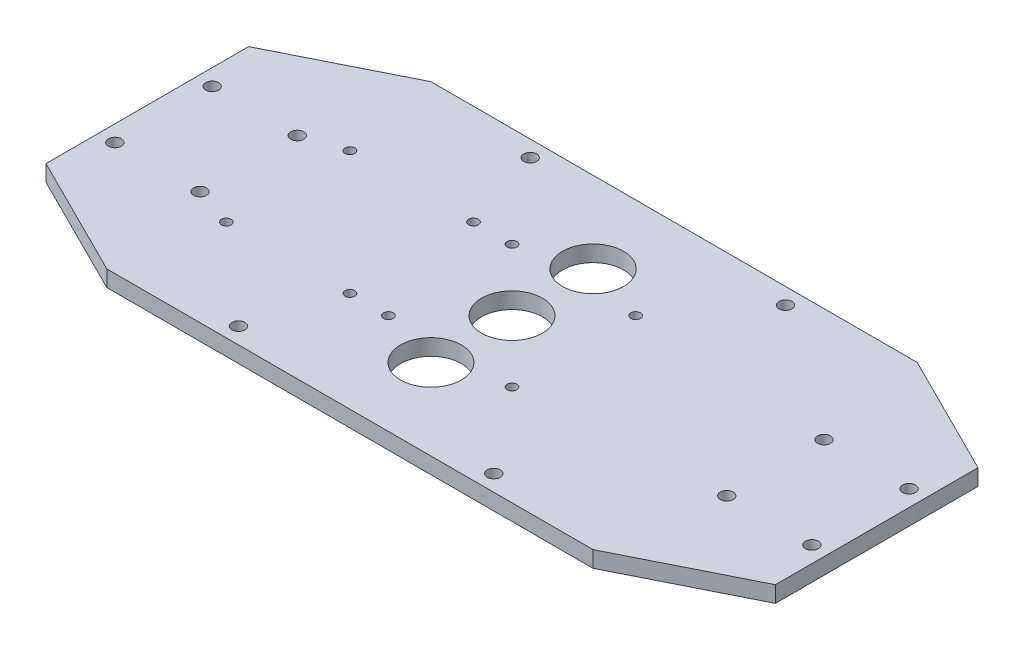
ISO-10303-21;
HEADER;
FILE_DESCRIPTION(('STEP AP214'),'2;1');
FILE_NAME('part.step','',(''),(''),'','','');
FILE_SCHEMA(('AUTOMOTIVE_DESIGN { 1 0 10303 214 1 1 1 1 }'));
ENDSEC;
DATA;
#1=APPLICATION_CONTEXT('core data for automotive mechanical design processes');
#2=APPLICATION_PROTOCOL_DEFINITION('international standard','automotive_design',2000,#1);
#3=PRODUCT_CONTEXT('',#1,'mechanical');
#4=PRODUCT('Part','Part','',(#3));
#5=PRODUCT_RELATED_PRODUCT_CATEGORY('part','',(#4));
#6=PRODUCT_DEFINITION_FORMATION('','',#4);
#7=PRODUCT_DEFINITION_CONTEXT('part definition',#1,'design');
#8=PRODUCT_DEFINITION('design','',#6,#7);
#9=PRODUCT_DEFINITION_SHAPE('','',#8);
#10=(LENGTH_UNIT() NAMED_UNIT(*) SI_UNIT(.MILLI.,.METRE.));
#11=(NAMED_UNIT(*) PLANE_ANGLE_UNIT() SI_UNIT($,.RADIAN.));
#12=(NAMED_UNIT(*) SI_UNIT($,.STERADIAN.) SOLID_ANGLE_UNIT());
#13=UNCERTAINTY_MEASURE_WITH_UNIT(LENGTH_MEASURE(1.E-05),#10,'distance_accuracy_value','');
#14=(GEOMETRIC_REPRESENTATION_CONTEXT(3) GLOBAL_UNCERTAINTY_ASSIGNED_CONTEXT((#13)) GLOBAL_UNIT_ASSIGNED_CONTEXT((#10,
#11,#12)) REPRESENTATION_CONTEXT('',''));
#15=CARTESIAN_POINT('',(0.,0.,0.));
#16=DIRECTION('',(0.,0.,1.));
#17=DIRECTION('',(1.,0.,0.));
#18=AXIS2_PLACEMENT_3D('',#15,#16,#17);
#19=CARTESIAN_POINT('',(0.,4.,0.));
#20=DIRECTION('',(0.,-1.,0.));
#21=DIRECTION('',(0.,0.,-1.));
#22=AXIS2_PLACEMENT_3D('',#19,#20,#21);
#23=PLANE('',#22);
#24=CARTESIAN_POINT('',(90.0000000000004,4.,-60.));
#25=DIRECTION('',(0.,1.,0.));
#26=DIRECTION('',(0.,0.,1.));
#27=AXIS2_PLACEMENT_3D('',#24,#25,#26);
#28=CIRCLE('',#27,7.53400516805174);
#29=CARTESIAN_POINT('',(90.0000000000004,4.,-52.4659948319483));
#30=VERTEX_POINT('',#29);
#31=EDGE_CURVE('E142',#30,#30,#28,.T.);
#32=ORIENTED_EDGE('',*,*,#31,.F.);
#33=EDGE_LOOP('',(#32));
#34=FACE_BOUND('',#33,.T.);
#35=CARTESIAN_POINT('',(90.0000000000004,4.,-40.));
#36=DIRECTION('',(0.,1.,0.));
#37=DIRECTION('',(0.,0.,1.));
#38=AXIS2_PLACEMENT_3D('',#35,#36,#37);
#39=CIRCLE('',#38,7.50000000000001);
#40=CARTESIAN_POINT('',(90.0000000000004,4.,-32.5));
#41=VERTEX_POINT('',#40);
#42=EDGE_CURVE('E625',#41,#41,#39,.T.);
#43=ORIENTED_EDGE('',*,*,#42,.F.);
#44=EDGE_LOOP('',(#43));
#45=FACE_BOUND('',#44,.T.);
#46=CARTESIAN_POINT('',(90.0000000000004,4.,-20.));
#47=DIRECTION('',(0.,1.,0.));
#48=DIRECTION('',(0.,0.,1.));
#49=AXIS2_PLACEMENT_3D('',#46,#47,#48);
#50=CIRCLE('',#49,7.50000000000001);
#51=CARTESIAN_POINT('',(90.0000000000004,4.,-12.5));
#52=VERTEX_POINT('',#51);
#53=EDGE_CURVE('E159',#52,#52,#50,.T.);
#54=ORIENTED_EDGE('',*,*,#53,.F.);
#55=EDGE_LOOP('',(#54));
#56=FACE_BOUND('',#55,.T.);
#57=CARTESIAN_POINT('',(3.99999999999812,4.,-52.0000000000011));
#58=DIRECTION('',(0.,1.,0.));
#59=DIRECTION('',(0.,0.,1.));
#60=AXIS2_PLACEMENT_3D('',#57,#58,#59);
#61=CIRCLE('',#60,1.59999999999999);
#62=CARTESIAN_POINT('',(3.99999999999812,4.,-50.4000000000011));
#63=VERTEX_POINT('',#62);
#64=EDGE_CURVE('E147',#63,#63,#61,.T.);
#65=ORIENTED_EDGE('',*,*,#64,.F.);
#66=EDGE_LOOP('',(#65));
#67=FACE_BOUND('',#66,.T.);
#68=CARTESIAN_POINT('',(24.9999999999979,4.,-28.0000000000009));
#69=DIRECTION('',(0.,1.,0.));
#70=DIRECTION('',(0.,0.,1.));
#71=AXIS2_PLACEMENT_3D('',#68,#69,#70);
#72=CIRCLE('',#71,1.59999999999999);
#73=CARTESIAN_POINT('',(24.9999999999979,4.,-26.4000000000009));
#74=VERTEX_POINT('',#73);
#75=EDGE_CURVE('E167',#74,#74,#72,.T.);
#76=ORIENTED_EDGE('',*,*,#75,.F.);
#77=EDGE_LOOP('',(#76));
#78=FACE_BOUND('',#77,.T.);
#79=CARTESIAN_POINT('',(24.9999999999981,4.,-52.0000000000009));
#80=DIRECTION('',(0.,1.,0.));
#81=DIRECTION('',(0.,0.,1.));
#82=AXIS2_PLACEMENT_3D('',#79,#80,#81);
#83=CIRCLE('',#82,1.59999999999999);
#84=CARTESIAN_POINT('',(24.9999999999981,4.,-50.4000000000009));
#85=VERTEX_POINT('',#84);
#86=EDGE_CURVE('E173',#85,#85,#83,.T.);
#87=ORIENTED_EDGE('',*,*,#86,.F.);
#88=EDGE_LOOP('',(#87));
#89=FACE_BOUND('',#88,.T.);
#90=CARTESIAN_POINT('',(121.499999999739,4.,-76.0000000000001));
#91=DIRECTION('',(0.,1.,0.));
#92=DIRECTION('',(0.,0.,1.));
#93=AXIS2_PLACEMENT_3D('',#90,#91,#92);
#94=CIRCLE('',#93,1.59999999999999);
#95=CARTESIAN_POINT('',(121.499999999739,4.,-74.4000000000001));
#96=VERTEX_POINT('',#95);
#97=EDGE_CURVE('E197',#96,#96,#94,.T.);
#98=ORIENTED_EDGE('',*,*,#97,.F.);
#99=EDGE_LOOP('',(#98));
#100=FACE_BOUND('',#99,.T.);
#101=CARTESIAN_POINT('',(154.999999999999,4.,-52.0000000000001));
#102=DIRECTION('',(0.,1.,0.));
#103=DIRECTION('',(0.,0.,1.));
#104=AXIS2_PLACEMENT_3D('',#101,#102,#103);
#105=CIRCLE('',#104,1.59999999999999);
#106=CARTESIAN_POINT('',(154.999999999999,4.,-50.4000000000002));
#107=VERTEX_POINT('',#106);
#108=EDGE_CURVE('E203',#107,#107,#105,.T.);
#109=ORIENTED_EDGE('',*,*,#108,.F.);
#110=EDGE_LOOP('',(#109));
#111=FACE_BOUND('',#110,.T.);
#112=CARTESIAN_POINT('',(175.999999999999,4.,-52.0000000000001));
#113=DIRECTION('',(0.,1.,0.));
#114=DIRECTION('',(0.,0.,1.));
#115=AXIS2_PLACEMENT_3D('',#112,#113,#114);
#116=CIRCLE('',#115,1.59999999999999);
#117=CARTESIAN_POINT('',(175.999999999999,4.,-50.4000000000001));
#118=VERTEX_POINT('',#117);
#119=EDGE_CURVE('E209',#118,#118,#116,.T.);
#120=ORIENTED_EDGE('',*,*,#119,.F.);
#121=EDGE_LOOP('',(#120));
#122=FACE_BOUND('',#121,.T.);
#123=CARTESIAN_POINT('',(175.999999999999,4.,-28.0000000000001));
#124=DIRECTION('',(0.,1.,0.));
#125=DIRECTION('',(0.,0.,1.));
#126=AXIS2_PLACEMENT_3D('',#123,#124,#125);
#127=CIRCLE('',#126,1.59999999999999);
#128=CARTESIAN_POINT('',(175.999999999999,4.,-26.4000000000001));
#129=VERTEX_POINT('',#128);
#130=EDGE_CURVE('E215',#129,#129,#127,.T.);
#131=ORIENTED_EDGE('',*,*,#130,.F.);
#132=EDGE_LOOP('',(#131));
#133=FACE_BOUND('',#132,.T.);
#134=CARTESIAN_POINT('',(154.999999999999,4.,-28.0000000000001));
#135=DIRECTION('',(0.,1.,0.));
#136=DIRECTION('',(0.,0.,1.));
#137=AXIS2_PLACEMENT_3D('',#134,#135,#136);
#138=CIRCLE('',#137,1.59999999999999);
#139=CARTESIAN_POINT('',(154.999999999999,4.,-26.4000000000002));
#140=VERTEX_POINT('',#139);
#141=EDGE_CURVE('E221',#140,#140,#138,.T.);
#142=ORIENTED_EDGE('',*,*,#141,.F.);
#143=EDGE_LOOP('',(#142));
#144=FACE_BOUND('',#143,.T.);
#145=CARTESIAN_POINT('',(34.75,4.,-24.75));
#146=DIRECTION('',(0.,1.,0.));
#147=DIRECTION('',(0.,0.,1.));
#148=AXIS2_PLACEMENT_3D('',#145,#146,#147);
#149=CIRCLE('',#148,1.19999999999999);
#150=CARTESIAN_POINT('',(34.75,4.,-23.55));
#151=VERTEX_POINT('',#150);
#152=EDGE_CURVE('E227',#151,#151,#149,.T.);
#153=ORIENTED_EDGE('',*,*,#152,.F.);
#154=EDGE_LOOP('',(#153));
#155=FACE_BOUND('',#154,.T.);
#156=CARTESIAN_POINT('',(65.25,4.,-24.75));
#157=DIRECTION('',(0.,1.,0.));
#158=DIRECTION('',(0.,0.,1.));
#159=AXIS2_PLACEMENT_3D('',#156,#157,#158);
#160=CIRCLE('',#159,1.19999999999999);
#161=CARTESIAN_POINT('',(65.25,4.,-23.55));
#162=VERTEX_POINT('',#161);
#163=EDGE_CURVE('E233',#162,#162,#160,.T.);
#164=ORIENTED_EDGE('',*,*,#163,.F.);
#165=EDGE_LOOP('',(#164));
#166=FACE_BOUND('',#165,.T.);
#167=CARTESIAN_POINT('',(65.25,4.,-55.25));
#168=DIRECTION('',(0.,1.,0.));
#169=DIRECTION('',(0.,0.,1.));
#170=AXIS2_PLACEMENT_3D('',#167,#168,#169);
#171=CIRCLE('',#170,1.19999999999999);
#172=CARTESIAN_POINT('',(65.25,4.,-54.05));
#173=VERTEX_POINT('',#172);
#174=EDGE_CURVE('E239',#173,#173,#171,.T.);
#175=ORIENTED_EDGE('',*,*,#174,.F.);
#176=EDGE_LOOP('',(#175));
#177=FACE_BOUND('',#176,.T.);
#178=CARTESIAN_POINT('',(34.75,4.,-55.25));
#179=DIRECTION('',(0.,1.,0.));
#180=DIRECTION('',(0.,0.,1.));
#181=AXIS2_PLACEMENT_3D('',#178,#179,#180);
#182=CIRCLE('',#181,1.19999999999999);
#183=CARTESIAN_POINT('',(34.75,4.,-54.05));
#184=VERTEX_POINT('',#183);
#185=EDGE_CURVE('E245',#184,#184,#182,.T.);
#186=ORIENTED_EDGE('',*,*,#185,.F.);
#187=EDGE_LOOP('',(#186));
#188=FACE_BOUND('',#187,.T.);
#189=CARTESIAN_POINT('',(74.75,4.,-55.25));
#190=DIRECTION('',(0.,1.,0.));
#191=DIRECTION('',(0.,0.,1.));
#192=AXIS2_PLACEMENT_3D('',#189,#190,#191);
#193=CIRCLE('',#192,1.19999999999999);
#194=CARTESIAN_POINT('',(74.75,4.,-54.05));
#195=VERTEX_POINT('',#194);
#196=EDGE_CURVE('E251',#195,#195,#193,.T.);
#197=ORIENTED_EDGE('',*,*,#196,.F.);
#198=EDGE_LOOP('',(#197));
#199=FACE_BOUND('',#198,.T.);
#200=CARTESIAN_POINT('',(105.25,4.,-55.25));
#201=DIRECTION('',(0.,1.,0.));
#202=DIRECTION('',(0.,0.,1.));
#203=AXIS2_PLACEMENT_3D('',#200,#201,#202);
#204=CIRCLE('',#203,1.19999999999999);
#205=CARTESIAN_POINT('',(105.25,4.,-54.05));
#206=VERTEX_POINT('',#205);
#207=EDGE_CURVE('E257',#206,#206,#204,.T.);
#208=ORIENTED_EDGE('',*,*,#207,.F.);
#209=EDGE_LOOP('',(#208));
#210=FACE_BOUND('',#209,.T.);
#211=CARTESIAN_POINT('',(105.25,4.,-24.75));
#212=DIRECTION('',(0.,1.,0.));
#213=DIRECTION('',(0.,0.,1.));
#214=AXIS2_PLACEMENT_3D('',#211,#212,#213);
#215=CIRCLE('',#214,1.19999999999999);
#216=CARTESIAN_POINT('',(105.25,4.,-23.55));
#217=VERTEX_POINT('',#216);
#218=EDGE_CURVE('E263',#217,#217,#215,.T.);
#219=ORIENTED_EDGE('',*,*,#218,.F.);
#220=EDGE_LOOP('',(#219));
#221=FACE_BOUND('',#220,.T.);
#222=CARTESIAN_POINT('',(74.75,4.,-24.75));
#223=DIRECTION('',(0.,1.,0.));
#224=DIRECTION('',(0.,0.,1.));
#225=AXIS2_PLACEMENT_3D('',#222,#223,#224);
#226=CIRCLE('',#225,1.19999999999999);
#227=CARTESIAN_POINT('',(74.75,4.,-23.55));
#228=VERTEX_POINT('',#227);
#229=EDGE_CURVE('E269',#228,#228,#226,.T.);
#230=ORIENTED_EDGE('',*,*,#229,.F.);
#231=EDGE_LOOP('',(#230));
#232=FACE_BOUND('',#231,.T.);
#233=DIRECTION('',(1.,0.,0.));
#234=VECTOR('',#233,1.);
#235=CARTESIAN_POINT('',(0.,4.,0.));
#236=LINE('',#235,#234);
#237=CARTESIAN_POINT('',(30.,4.,0.));
#238=VERTEX_POINT('',#237);
#239=CARTESIAN_POINT('',(150.,4.,0.));
#240=VERTEX_POINT('',#239);
#241=EDGE_CURVE('E296',#238,#240,#236,.T.);
#242=ORIENTED_EDGE('',*,*,#241,.T.);
#243=DIRECTION('',(-0.894427190999916,0.,0.447213595499958));
#244=VECTOR('',#243,1.);
#245=CARTESIAN_POINT('',(180.,4.,-15.));
#246=LINE('',#245,#244);
#247=CARTESIAN_POINT('',(180.,4.,-15.));
#248=VERTEX_POINT('',#247);
#249=EDGE_CURVE('E274',#248,#240,#246,.T.);
#250=ORIENTED_EDGE('',*,*,#249,.F.);
#251=DIRECTION('',(0.,0.,-1.));
#252=VECTOR('',#251,1.);
#253=CARTESIAN_POINT('',(180.,4.,0.));
#254=LINE('',#253,#252);
#255=CARTESIAN_POINT('',(180.,4.,-65.));
#256=VERTEX_POINT('',#255);
#257=EDGE_CURVE('E42',#248,#256,#254,.T.);
#258=ORIENTED_EDGE('',*,*,#257,.T.);
#259=DIRECTION('',(0.894427190999916,0.,0.447213595499958));
#260=VECTOR('',#259,1.);
#261=CARTESIAN_POINT('',(180.,4.,-65.));
#262=LINE('',#261,#260);
#263=CARTESIAN_POINT('',(150.,4.,-80.));
#264=VERTEX_POINT('',#263);
#265=EDGE_CURVE('E282',#264,#256,#262,.T.);
#266=ORIENTED_EDGE('',*,*,#265,.F.);
#267=DIRECTION('',(-1.,0.,0.));
#268=VECTOR('',#267,1.);
#269=CARTESIAN_POINT('',(0.,4.,-80.));
#270=LINE('',#269,#268);
#271=CARTESIAN_POINT('',(30.,4.,-80.));
#272=VERTEX_POINT('',#271);
#273=EDGE_CURVE('E11',#264,#272,#270,.T.);
#274=ORIENTED_EDGE('',*,*,#273,.T.);
#275=DIRECTION('',(0.894427190999916,0.,-0.447213595499958));
#276=VECTOR('',#275,1.);
#277=CARTESIAN_POINT('',(30.,4.,-80.));
#278=LINE('',#277,#276);
#279=CARTESIAN_POINT('',(0.,4.,-65.));
#280=VERTEX_POINT('',#279);
#281=EDGE_CURVE('E110',#280,#272,#278,.T.);
#282=ORIENTED_EDGE('',*,*,#281,.F.);
#283=DIRECTION('',(0.,0.,1.));
#284=VECTOR('',#283,1.);
#285=CARTESIAN_POINT('',(0.,4.,0.));
#286=LINE('',#285,#284);
#287=CARTESIAN_POINT('',(0.,4.,-15.));
#288=VERTEX_POINT('',#287);
#289=EDGE_CURVE('E118',#280,#288,#286,.T.);
#290=ORIENTED_EDGE('',*,*,#289,.T.);
#291=DIRECTION('',(-0.894427190999916,0.,-0.447213595499958));
#292=VECTOR('',#291,1.);
#293=CARTESIAN_POINT('',(0.,4.,-15.));
#294=LINE('',#293,#292);
#295=EDGE_CURVE('E278',#238,#288,#294,.T.);
#296=ORIENTED_EDGE('',*,*,#295,.F.);
#297=EDGE_LOOP('',(#242,#250,#258,#266,#274,#282,#290,#296));
#298=FACE_BOUND('',#297,.T.);
#299=CARTESIAN_POINT('',(121.499999999739,4.,-4.0000000000001));
#300=DIRECTION('',(0.,1.,0.));
#301=DIRECTION('',(0.,0.,1.));
#302=AXIS2_PLACEMENT_3D('',#299,#300,#301);
#303=CIRCLE('',#302,1.59999999999999);
#304=CARTESIAN_POINT('',(121.499999999739,4.,-2.40000000000011));
#305=VERTEX_POINT('',#304);
#306=EDGE_CURVE('E191',#305,#305,#303,.T.);
#307=ORIENTED_EDGE('',*,*,#306,.F.);
#308=EDGE_LOOP('',(#307));
#309=FACE_BOUND('',#308,.T.);
#310=CARTESIAN_POINT('',(58.5000000002612,4.,-4.00000000000009));
#311=DIRECTION('',(0.,1.,0.));
#312=DIRECTION('',(0.,0.,1.));
#313=AXIS2_PLACEMENT_3D('',#310,#311,#312);
#314=CIRCLE('',#313,1.59999999999998);
#315=CARTESIAN_POINT('',(58.5000000002612,4.,-2.40000000000011));
#316=VERTEX_POINT('',#315);
#317=EDGE_CURVE('E185',#316,#316,#314,.T.);
#318=ORIENTED_EDGE('',*,*,#317,.F.);
#319=EDGE_LOOP('',(#318));
#320=FACE_BOUND('',#319,.T.);
#321=CARTESIAN_POINT('',(58.5000000002609,4.,-76.0000000000001));
#322=DIRECTION('',(0.,1.,0.));
#323=DIRECTION('',(0.,0.,1.));
#324=AXIS2_PLACEMENT_3D('',#321,#322,#323);
#325=CIRCLE('',#324,1.59999999999999);
#326=CARTESIAN_POINT('',(58.5000000002609,4.,-74.4000000000001));
#327=VERTEX_POINT('',#326);
#328=EDGE_CURVE('E179',#327,#327,#325,.T.);
#329=ORIENTED_EDGE('',*,*,#328,.F.);
#330=EDGE_LOOP('',(#329));
#331=FACE_BOUND('',#330,.T.);
#332=CARTESIAN_POINT('',(3.99999999999787,4.,-28.0000000000011));
#333=DIRECTION('',(0.,1.,0.));
#334=DIRECTION('',(0.,0.,1.));
#335=AXIS2_PLACEMENT_3D('',#332,#333,#334);
#336=CIRCLE('',#335,1.59999999999999);
#337=CARTESIAN_POINT('',(3.99999999999787,4.,-26.4000000000011));
#338=VERTEX_POINT('',#337);
#339=EDGE_CURVE('E156',#338,#338,#336,.T.);
#340=ORIENTED_EDGE('',*,*,#339,.F.);
#341=EDGE_LOOP('',(#340));
#342=FACE_BOUND('',#341,.T.);
#343=ADVANCED_FACE('F33',(#34,#45,#56,#67,#78,#89,#100,#111,#122,#133,#144,#155,#166,#177,#188,
#199,#210,#221,#232,#298,#309,#320,#331,#342),#23,.F.);
#344=CARTESIAN_POINT('',(0.,0.,0.));
#345=DIRECTION('',(0.,-1.,0.));
#346=DIRECTION('',(0.,0.,-1.));
#347=AXIS2_PLACEMENT_3D('',#344,#345,#346);
#348=PLANE('',#347);
#349=CARTESIAN_POINT('',(90.0000000000004,0.,-60.));
#350=DIRECTION('',(0.,-1.,0.));
#351=DIRECTION('',(0.,0.,-1.));
#352=AXIS2_PLACEMENT_3D('',#349,#350,#351);
#353=CIRCLE('',#352,7.53400516805174);
#354=CARTESIAN_POINT('',(90.0000000000004,0.,-67.5340051680518));
#355=VERTEX_POINT('',#354);
#356=EDGE_CURVE('E37',#355,#355,#353,.T.);
#357=ORIENTED_EDGE('',*,*,#356,.F.);
#358=EDGE_LOOP('',(#357));
#359=FACE_BOUND('',#358,.T.);
#360=CARTESIAN_POINT('',(90.0000000000004,0.,-40.));
#361=DIRECTION('',(0.,-1.,0.));
#362=DIRECTION('',(0.,0.,-1.));
#363=AXIS2_PLACEMENT_3D('',#360,#361,#362);
#364=CIRCLE('',#363,7.50000000000001);
#365=CARTESIAN_POINT('',(90.0000000000004,0.,-47.5));
#366=VERTEX_POINT('',#365);
#367=EDGE_CURVE('E141',#366,#366,#364,.T.);
#368=ORIENTED_EDGE('',*,*,#367,.F.);
#369=EDGE_LOOP('',(#368));
#370=FACE_BOUND('',#369,.T.);
#371=CARTESIAN_POINT('',(90.0000000000004,0.,-20.));
#372=DIRECTION('',(0.,-1.,0.));
#373=DIRECTION('',(0.,0.,-1.));
#374=AXIS2_PLACEMENT_3D('',#371,#372,#373);
#375=CIRCLE('',#374,7.50000000000001);
#376=CARTESIAN_POINT('',(90.0000000000004,0.,-27.5));
#377=VERTEX_POINT('',#376);
#378=EDGE_CURVE('E139',#377,#377,#375,.T.);
#379=ORIENTED_EDGE('',*,*,#378,.F.);
#380=EDGE_LOOP('',(#379));
#381=FACE_BOUND('',#380,.T.);
#382=CARTESIAN_POINT('',(3.99999999999812,0.,-52.0000000000011));
#383=DIRECTION('',(0.,-1.,0.));
#384=DIRECTION('',(0.,0.,-1.));
#385=AXIS2_PLACEMENT_3D('',#382,#383,#384);
#386=CIRCLE('',#385,1.59999999999999);
#387=CARTESIAN_POINT('',(3.99999999999812,0.,-53.6000000000011));
#388=VERTEX_POINT('',#387);
#389=EDGE_CURVE('E151',#388,#388,#386,.T.);
#390=ORIENTED_EDGE('',*,*,#389,.F.);
#391=EDGE_LOOP('',(#390));
#392=FACE_BOUND('',#391,.T.);
#393=CARTESIAN_POINT('',(3.99999999999787,0.,-28.0000000000011));
#394=DIRECTION('',(0.,-1.,0.));
#395=DIRECTION('',(0.,0.,-1.));
#396=AXIS2_PLACEMENT_3D('',#393,#394,#395);
#397=CIRCLE('',#396,1.59999999999999);
#398=CARTESIAN_POINT('',(3.99999999999787,0.,-29.6000000000011));
#399=VERTEX_POINT('',#398);
#400=EDGE_CURVE('E164',#399,#399,#397,.T.);
#401=ORIENTED_EDGE('',*,*,#400,.F.);
#402=EDGE_LOOP('',(#401));
#403=FACE_BOUND('',#402,.T.);
#404=CARTESIAN_POINT('',(24.9999999999979,0.,-28.0000000000009));
#405=DIRECTION('',(0.,-1.,0.));
#406=DIRECTION('',(0.,0.,-1.));
#407=AXIS2_PLACEMENT_3D('',#404,#405,#406);
#408=CIRCLE('',#407,1.59999999999999);
#409=CARTESIAN_POINT('',(24.9999999999979,0.,-29.6000000000009));
#410=VERTEX_POINT('',#409);
#411=EDGE_CURVE('E170',#410,#410,#408,.T.);
#412=ORIENTED_EDGE('',*,*,#411,.F.);
#413=EDGE_LOOP('',(#412));
#414=FACE_BOUND('',#413,.T.);
#415=CARTESIAN_POINT('',(24.9999999999981,0.,-52.0000000000009));
#416=DIRECTION('',(0.,-1.,0.));
#417=DIRECTION('',(0.,0.,-1.));
#418=AXIS2_PLACEMENT_3D('',#415,#416,#417);
#419=CIRCLE('',#418,1.59999999999999);
#420=CARTESIAN_POINT('',(24.9999999999981,0.,-53.6000000000009));
#421=VERTEX_POINT('',#420);
#422=EDGE_CURVE('E176',#421,#421,#419,.T.);
#423=ORIENTED_EDGE('',*,*,#422,.F.);
#424=EDGE_LOOP('',(#423));
#425=FACE_BOUND('',#424,.T.);
#426=CARTESIAN_POINT('',(58.5000000002609,0.,-76.0000000000001));
#427=DIRECTION('',(0.,-1.,0.));
#428=DIRECTION('',(0.,0.,-1.));
#429=AXIS2_PLACEMENT_3D('',#426,#427,#428);
#430=CIRCLE('',#429,1.59999999999999);
#431=CARTESIAN_POINT('',(58.5000000002609,0.,-77.6000000000001));
#432=VERTEX_POINT('',#431);
#433=EDGE_CURVE('E182',#432,#432,#430,.T.);
#434=ORIENTED_EDGE('',*,*,#433,.F.);
#435=EDGE_LOOP('',(#434));
#436=FACE_BOUND('',#435,.T.);
#437=CARTESIAN_POINT('',(58.5000000002612,0.,-4.00000000000009));
#438=DIRECTION('',(0.,-1.,0.));
#439=DIRECTION('',(0.,0.,-1.));
#440=AXIS2_PLACEMENT_3D('',#437,#438,#439);
#441=CIRCLE('',#440,1.59999999999999);
#442=CARTESIAN_POINT('',(58.5000000002612,0.,-5.60000000000008));
#443=VERTEX_POINT('',#442);
#444=EDGE_CURVE('E188',#443,#443,#441,.T.);
#445=ORIENTED_EDGE('',*,*,#444,.F.);
#446=EDGE_LOOP('',(#445));
#447=FACE_BOUND('',#446,.T.);
#448=CARTESIAN_POINT('',(121.499999999739,0.,-4.0000000000001));
#449=DIRECTION('',(0.,-1.,0.));
#450=DIRECTION('',(0.,0.,-1.));
#451=AXIS2_PLACEMENT_3D('',#448,#449,#450);
#452=CIRCLE('',#451,1.6);
#453=CARTESIAN_POINT('',(121.499999999739,0.,-5.6000000000001));
#454=VERTEX_POINT('',#453);
#455=EDGE_CURVE('E194',#454,#454,#452,.T.);
#456=ORIENTED_EDGE('',*,*,#455,.F.);
#457=EDGE_LOOP('',(#456));
#458=FACE_BOUND('',#457,.T.);
#459=CARTESIAN_POINT('',(121.499999999739,0.,-76.0000000000001));
#460=DIRECTION('',(0.,-1.,0.));
#461=DIRECTION('',(0.,0.,-1.));
#462=AXIS2_PLACEMENT_3D('',#459,#460,#461);
#463=CIRCLE('',#462,1.6);
#464=CARTESIAN_POINT('',(121.499999999739,0.,-77.6000000000001));
#465=VERTEX_POINT('',#464);
#466=EDGE_CURVE('E200',#465,#465,#463,.T.);
#467=ORIENTED_EDGE('',*,*,#466,.F.);
#468=EDGE_LOOP('',(#467));
#469=FACE_BOUND('',#468,.T.);
#470=CARTESIAN_POINT('',(154.999999999999,0.,-52.0000000000001));
#471=DIRECTION('',(0.,-1.,0.));
#472=DIRECTION('',(0.,0.,-1.));
#473=AXIS2_PLACEMENT_3D('',#470,#471,#472);
#474=CIRCLE('',#473,1.59999999999999);
#475=CARTESIAN_POINT('',(154.999999999999,0.,-53.6000000000001));
#476=VERTEX_POINT('',#475);
#477=EDGE_CURVE('E206',#476,#476,#474,.T.);
#478=ORIENTED_EDGE('',*,*,#477,.F.);
#479=EDGE_LOOP('',(#478));
#480=FACE_BOUND('',#479,.T.);
#481=CARTESIAN_POINT('',(175.999999999999,0.,-52.0000000000001));
#482=DIRECTION('',(0.,-1.,0.));
#483=DIRECTION('',(0.,0.,-1.));
#484=AXIS2_PLACEMENT_3D('',#481,#482,#483);
#485=CIRCLE('',#484,1.59999999999999);
#486=CARTESIAN_POINT('',(175.999999999999,0.,-53.6000000000001));
#487=VERTEX_POINT('',#486);
#488=EDGE_CURVE('E212',#487,#487,#485,.T.);
#489=ORIENTED_EDGE('',*,*,#488,.F.);
#490=EDGE_LOOP('',(#489));
#491=FACE_BOUND('',#490,.T.);
#492=CARTESIAN_POINT('',(175.999999999999,0.,-28.0000000000001));
#493=DIRECTION('',(0.,-1.,0.));
#494=DIRECTION('',(0.,0.,-1.));
#495=AXIS2_PLACEMENT_3D('',#492,#493,#494);
#496=CIRCLE('',#495,1.59999999999999);
#497=CARTESIAN_POINT('',(175.999999999999,0.,-29.6000000000001));
#498=VERTEX_POINT('',#497);
#499=EDGE_CURVE('E218',#498,#498,#496,.T.);
#500=ORIENTED_EDGE('',*,*,#499,.F.);
#501=EDGE_LOOP('',(#500));
#502=FACE_BOUND('',#501,.T.);
#503=CARTESIAN_POINT('',(154.999999999999,0.,-28.0000000000001));
#504=DIRECTION('',(0.,-1.,0.));
#505=DIRECTION('',(0.,0.,-1.));
#506=AXIS2_PLACEMENT_3D('',#503,#504,#505);
#507=CIRCLE('',#506,1.59999999999999);
#508=CARTESIAN_POINT('',(154.999999999999,0.,-29.6000000000001));
#509=VERTEX_POINT('',#508);
#510=EDGE_CURVE('E224',#509,#509,#507,.T.);
#511=ORIENTED_EDGE('',*,*,#510,.F.);
#512=EDGE_LOOP('',(#511));
#513=FACE_BOUND('',#512,.T.);
#514=CARTESIAN_POINT('',(34.75,0.,-24.75));
#515=DIRECTION('',(0.,1.,0.));
#516=DIRECTION('',(0.,0.,1.));
#517=AXIS2_PLACEMENT_3D('',#514,#515,#516);
#518=CIRCLE('',#517,1.2);
#519=CARTESIAN_POINT('',(34.75,0.,-23.55));
#520=VERTEX_POINT('',#519);
#521=EDGE_CURVE('E230',#520,#520,#518,.T.);
#522=ORIENTED_EDGE('',*,*,#521,.T.);
#523=EDGE_LOOP('',(#522));
#524=FACE_BOUND('',#523,.T.);
#525=CARTESIAN_POINT('',(65.25,0.,-24.75));
#526=DIRECTION('',(0.,1.,0.));
#527=DIRECTION('',(0.,0.,1.));
#528=AXIS2_PLACEMENT_3D('',#525,#526,#527);
#529=CIRCLE('',#528,1.19999999999999);
#530=CARTESIAN_POINT('',(65.25,0.,-23.55));
#531=VERTEX_POINT('',#530);
#532=EDGE_CURVE('E236',#531,#531,#529,.T.);
#533=ORIENTED_EDGE('',*,*,#532,.T.);
#534=EDGE_LOOP('',(#533));
#535=FACE_BOUND('',#534,.T.);
#536=DIRECTION('',(-0.894427190999916,0.,0.447213595499958));
#537=VECTOR('',#536,1.);
#538=CARTESIAN_POINT('',(180.,0.,-15.));
#539=LINE('',#538,#537);
#540=CARTESIAN_POINT('',(180.,0.,-15.));
#541=VERTEX_POINT('',#540);
#542=CARTESIAN_POINT('',(150.,0.,0.));
#543=VERTEX_POINT('',#542);
#544=EDGE_CURVE('E286',#541,#543,#539,.T.);
#545=ORIENTED_EDGE('',*,*,#544,.T.);
#546=DIRECTION('',(1.,0.,0.));
#547=VECTOR('',#546,1.);
#548=CARTESIAN_POINT('',(0.,0.,0.));
#549=LINE('',#548,#547);
#550=CARTESIAN_POINT('',(30.,0.,0.));
#551=VERTEX_POINT('',#550);
#552=EDGE_CURVE('E125',#551,#543,#549,.T.);
#553=ORIENTED_EDGE('',*,*,#552,.F.);
#554=DIRECTION('',(-0.894427190999916,0.,-0.447213595499958));
#555=VECTOR('',#554,1.);
#556=CARTESIAN_POINT('',(0.,0.,-15.));
#557=LINE('',#556,#555);
#558=CARTESIAN_POINT('',(0.,0.,-15.));
#559=VERTEX_POINT('',#558);
#560=EDGE_CURVE('E124',#551,#559,#557,.T.);
#561=ORIENTED_EDGE('',*,*,#560,.T.);
#562=DIRECTION('',(0.,0.,1.));
#563=VECTOR('',#562,1.);
#564=CARTESIAN_POINT('',(0.,0.,0.));
#565=LINE('',#564,#563);
#566=CARTESIAN_POINT('',(0.,0.,-65.));
#567=VERTEX_POINT('',#566);
#568=EDGE_CURVE('E116',#567,#559,#565,.T.);
#569=ORIENTED_EDGE('',*,*,#568,.F.);
#570=DIRECTION('',(0.894427190999916,0.,-0.447213595499958));
#571=VECTOR('',#570,1.);
#572=CARTESIAN_POINT('',(30.,0.,-80.));
#573=LINE('',#572,#571);
#574=CARTESIAN_POINT('',(30.0000000000001,0.,-80.));
#575=VERTEX_POINT('',#574);
#576=EDGE_CURVE('E99',#567,#575,#573,.T.);
#577=ORIENTED_EDGE('',*,*,#576,.T.);
#578=DIRECTION('',(-1.,0.,0.));
#579=VECTOR('',#578,1.);
#580=CARTESIAN_POINT('',(0.,0.,-80.));
#581=LINE('',#580,#579);
#582=CARTESIAN_POINT('',(150.,0.,-80.));
#583=VERTEX_POINT('',#582);
#584=EDGE_CURVE('E137',#583,#575,#581,.T.);
#585=ORIENTED_EDGE('',*,*,#584,.F.);
#586=DIRECTION('',(0.894427190999916,0.,0.447213595499958));
#587=VECTOR('',#586,1.);
#588=CARTESIAN_POINT('',(180.,0.,-65.));
#589=LINE('',#588,#587);
#590=CARTESIAN_POINT('',(180.,0.,-65.));
#591=VERTEX_POINT('',#590);
#592=EDGE_CURVE('E280',#583,#591,#589,.T.);
#593=ORIENTED_EDGE('',*,*,#592,.T.);
#594=DIRECTION('',(0.,0.,-1.));
#595=VECTOR('',#594,1.);
#596=CARTESIAN_POINT('',(180.,0.,0.));
#597=LINE('',#596,#595);
#598=EDGE_CURVE('E129',#541,#591,#597,.T.);
#599=ORIENTED_EDGE('',*,*,#598,.F.);
#600=EDGE_LOOP('',(#545,#553,#561,#569,#577,#585,#593,#599));
#601=FACE_BOUND('',#600,.T.);
#602=CARTESIAN_POINT('',(74.75,0.,-24.75));
#603=DIRECTION('',(0.,1.,0.));
#604=DIRECTION('',(0.,0.,1.));
#605=AXIS2_PLACEMENT_3D('',#602,#603,#604);
#606=CIRCLE('',#605,1.19999999999999);
#607=CARTESIAN_POINT('',(74.75,0.,-23.55));
#608=VERTEX_POINT('',#607);
#609=EDGE_CURVE('E272',#608,#608,#606,.T.);
#610=ORIENTED_EDGE('',*,*,#609,.T.);
#611=EDGE_LOOP('',(#610));
#612=FACE_BOUND('',#611,.T.);
#613=CARTESIAN_POINT('',(105.25,0.,-24.75));
#614=DIRECTION('',(0.,1.,0.));
#615=DIRECTION('',(0.,0.,1.));
#616=AXIS2_PLACEMENT_3D('',#613,#614,#615);
#617=CIRCLE('',#616,1.19999999999999);
#618=CARTESIAN_POINT('',(105.25,0.,-23.55));
#619=VERTEX_POINT('',#618);
#620=EDGE_CURVE('E266',#619,#619,#617,.T.);
#621=ORIENTED_EDGE('',*,*,#620,.T.);
#622=EDGE_LOOP('',(#621));
#623=FACE_BOUND('',#622,.T.);
#624=CARTESIAN_POINT('',(105.25,0.,-55.25));
#625=DIRECTION('',(0.,1.,0.));
#626=DIRECTION('',(0.,0.,1.));
#627=AXIS2_PLACEMENT_3D('',#624,#625,#626);
#628=CIRCLE('',#627,1.19999999999999);
#629=CARTESIAN_POINT('',(105.25,0.,-54.05));
#630=VERTEX_POINT('',#629);
#631=EDGE_CURVE('E260',#630,#630,#628,.T.);
#632=ORIENTED_EDGE('',*,*,#631,.T.);
#633=EDGE_LOOP('',(#632));
#634=FACE_BOUND('',#633,.T.);
#635=CARTESIAN_POINT('',(74.75,0.,-55.25));
#636=DIRECTION('',(0.,1.,0.));
#637=DIRECTION('',(0.,0.,1.));
#638=AXIS2_PLACEMENT_3D('',#635,#636,#637);
#639=CIRCLE('',#638,1.19999999999999);
#640=CARTESIAN_POINT('',(74.75,0.,-54.05));
#641=VERTEX_POINT('',#640);
#642=EDGE_CURVE('E254',#641,#641,#639,.T.);
#643=ORIENTED_EDGE('',*,*,#642,.T.);
#644=EDGE_LOOP('',(#643));
#645=FACE_BOUND('',#644,.T.);
#646=CARTESIAN_POINT('',(34.75,0.,-55.25));
#647=DIRECTION('',(0.,1.,0.));
#648=DIRECTION('',(0.,0.,1.));
#649=AXIS2_PLACEMENT_3D('',#646,#647,#648);
#650=CIRCLE('',#649,1.2);
#651=CARTESIAN_POINT('',(34.75,0.,-54.05));
#652=VERTEX_POINT('',#651);
#653=EDGE_CURVE('E248',#652,#652,#650,.T.);
#654=ORIENTED_EDGE('',*,*,#653,.T.);
#655=EDGE_LOOP('',(#654));
#656=FACE_BOUND('',#655,.T.);
#657=CARTESIAN_POINT('',(65.25,0.,-55.25));
#658=DIRECTION('',(0.,1.,0.));
#659=DIRECTION('',(0.,0.,1.));
#660=AXIS2_PLACEMENT_3D('',#657,#658,#659);
#661=CIRCLE('',#660,1.19999999999999);
#662=CARTESIAN_POINT('',(65.25,0.,-54.05));
#663=VERTEX_POINT('',#662);
#664=EDGE_CURVE('E242',#663,#663,#661,.T.);
#665=ORIENTED_EDGE('',*,*,#664,.T.);
#666=EDGE_LOOP('',(#665));
#667=FACE_BOUND('',#666,.T.);
#668=ADVANCED_FACE('F121',(#359,#370,#381,#392,#403,#414,#425,#436,#447,#458,#469,#480,#491,
#502,#513,#524,#535,#601,#612,#623,#634,#645,#656,#667),#348,.T.);
#669=CARTESIAN_POINT('',(0.,4.,0.));
#670=DIRECTION('',(1.,0.,0.));
#671=DIRECTION('',(0.,0.,-1.));
#672=AXIS2_PLACEMENT_3D('',#669,#670,#671);
#673=PLANE('',#672);
#674=ORIENTED_EDGE('',*,*,#289,.F.);
#675=DIRECTION('',(0.,1.,0.));
#676=VECTOR('',#675,1.);
#677=CARTESIAN_POINT('',(0.,0.,-65.));
#678=LINE('',#677,#676);
#679=EDGE_CURVE('E102',#567,#280,#678,.T.);
#680=ORIENTED_EDGE('',*,*,#679,.F.);
#681=ORIENTED_EDGE('',*,*,#568,.T.);
#682=DIRECTION('',(0.,1.,0.));
#683=VECTOR('',#682,1.);
#684=CARTESIAN_POINT('',(0.,0.,-15.));
#685=LINE('',#684,#683);
#686=EDGE_CURVE('E126',#559,#288,#685,.T.);
#687=ORIENTED_EDGE('',*,*,#686,.T.);
#688=EDGE_LOOP('',(#674,#680,#681,#687));
#689=FACE_BOUND('',#688,.T.);
#690=ADVANCED_FACE('F35',(#689),#673,.F.);
#691=CARTESIAN_POINT('',(0.,4.,0.));
#692=DIRECTION('',(0.,0.,-1.));
#693=DIRECTION('',(-1.,0.,0.));
#694=AXIS2_PLACEMENT_3D('',#691,#692,#693);
#695=PLANE('',#694);
#696=ORIENTED_EDGE('',*,*,#552,.T.);
#697=DIRECTION('',(0.,1.,0.));
#698=VECTOR('',#697,1.);
#699=CARTESIAN_POINT('',(150.,0.,0.));
#700=LINE('',#699,#698);
#701=EDGE_CURVE('E50',#543,#240,#700,.T.);
#702=ORIENTED_EDGE('',*,*,#701,.T.);
#703=ORIENTED_EDGE('',*,*,#241,.F.);
#704=DIRECTION('',(0.,1.,0.));
#705=VECTOR('',#704,1.);
#706=CARTESIAN_POINT('',(30.,0.,0.));
#707=LINE('',#706,#705);
#708=EDGE_CURVE('E131',#551,#238,#707,.T.);
#709=ORIENTED_EDGE('',*,*,#708,.F.);
#710=EDGE_LOOP('',(#696,#702,#703,#709));
#711=FACE_BOUND('',#710,.T.);
#712=ADVANCED_FACE('F318',(#711),#695,.F.);
#713=CARTESIAN_POINT('',(180.,4.,0.));
#714=DIRECTION('',(-1.,0.,0.));
#715=DIRECTION('',(0.,0.,1.));
#716=AXIS2_PLACEMENT_3D('',#713,#714,#715);
#717=PLANE('',#716);
#718=ORIENTED_EDGE('',*,*,#257,.F.);
#719=DIRECTION('',(0.,1.,0.));
#720=VECTOR('',#719,1.);
#721=CARTESIAN_POINT('',(180.,0.,-15.));
#722=LINE('',#721,#720);
#723=EDGE_CURVE('E288',#541,#248,#722,.T.);
#724=ORIENTED_EDGE('',*,*,#723,.F.);
#725=ORIENTED_EDGE('',*,*,#598,.T.);
#726=DIRECTION('',(0.,1.,0.));
#727=VECTOR('',#726,1.);
#728=CARTESIAN_POINT('',(180.,0.,-65.));
#729=LINE('',#728,#727);
#730=EDGE_CURVE('E58',#591,#256,#729,.T.);
#731=ORIENTED_EDGE('',*,*,#730,.T.);
#732=EDGE_LOOP('',(#718,#724,#725,#731));
#733=FACE_BOUND('',#732,.T.);
#734=ADVANCED_FACE('F307',(#733),#717,.F.);
#735=CARTESIAN_POINT('',(0.,4.,-80.));
#736=DIRECTION('',(0.,0.,1.));
#737=DIRECTION('',(1.,0.,0.));
#738=AXIS2_PLACEMENT_3D('',#735,#736,#737);
#739=PLANE('',#738);
#740=ORIENTED_EDGE('',*,*,#273,.F.);
#741=DIRECTION('',(0.,1.,0.));
#742=VECTOR('',#741,1.);
#743=CARTESIAN_POINT('',(150.,0.,-80.));
#744=LINE('',#743,#742);
#745=EDGE_CURVE('E277',#583,#264,#744,.T.);
#746=ORIENTED_EDGE('',*,*,#745,.F.);
#747=ORIENTED_EDGE('',*,*,#584,.T.);
#748=DIRECTION('',(0.,1.,0.));
#749=VECTOR('',#748,1.);
#750=CARTESIAN_POINT('',(30.,0.,-80.));
#751=LINE('',#750,#749);
#752=EDGE_CURVE('E105',#575,#272,#751,.T.);
#753=ORIENTED_EDGE('',*,*,#752,.T.);
#754=EDGE_LOOP('',(#740,#746,#747,#753));
#755=FACE_BOUND('',#754,.T.);
#756=ADVANCED_FACE('F312',(#755),#739,.F.);
#757=CARTESIAN_POINT('',(0.,0.,-15.));
#758=DIRECTION('',(0.447213595499958,0.,-0.894427190999916));
#759=DIRECTION('',(-0.894427190999916,0.,-0.447213595499958));
#760=AXIS2_PLACEMENT_3D('',#757,#758,#759);
#761=PLANE('',#760);
#762=ORIENTED_EDGE('',*,*,#295,.T.);
#763=ORIENTED_EDGE('',*,*,#686,.F.);
#764=ORIENTED_EDGE('',*,*,#560,.F.);
#765=ORIENTED_EDGE('',*,*,#708,.T.);
#766=EDGE_LOOP('',(#762,#763,#764,#765));
#767=FACE_BOUND('',#766,.T.);
#768=ADVANCED_FACE('F319',(#767),#761,.F.);
#769=CARTESIAN_POINT('',(30.,0.,-80.));
#770=DIRECTION('',(0.447213595499958,0.,0.894427190999916));
#771=DIRECTION('',(0.894427190999916,0.,-0.447213595499958));
#772=AXIS2_PLACEMENT_3D('',#769,#770,#771);
#773=PLANE('',#772);
#774=ORIENTED_EDGE('',*,*,#281,.T.);
#775=ORIENTED_EDGE('',*,*,#752,.F.);
#776=ORIENTED_EDGE('',*,*,#576,.F.);
#777=ORIENTED_EDGE('',*,*,#679,.T.);
#778=EDGE_LOOP('',(#774,#775,#776,#777));
#779=FACE_BOUND('',#778,.T.);
#780=ADVANCED_FACE('F101',(#779),#773,.F.);
#781=CARTESIAN_POINT('',(180.,0.,-65.));
#782=DIRECTION('',(-0.447213595499958,0.,0.894427190999916));
#783=DIRECTION('',(0.894427190999916,0.,0.447213595499958));
#784=AXIS2_PLACEMENT_3D('',#781,#782,#783);
#785=PLANE('',#784);
#786=ORIENTED_EDGE('',*,*,#265,.T.);
#787=ORIENTED_EDGE('',*,*,#730,.F.);
#788=ORIENTED_EDGE('',*,*,#592,.F.);
#789=ORIENTED_EDGE('',*,*,#745,.T.);
#790=EDGE_LOOP('',(#786,#787,#788,#789));
#791=FACE_BOUND('',#790,.T.);
#792=ADVANCED_FACE('F310',(#791),#785,.F.);
#793=CARTESIAN_POINT('',(180.,0.,-15.));
#794=DIRECTION('',(-0.447213595499958,0.,-0.894427190999916));
#795=DIRECTION('',(-0.894427190999916,0.,0.447213595499958));
#796=AXIS2_PLACEMENT_3D('',#793,#794,#795);
#797=PLANE('',#796);
#798=ORIENTED_EDGE('',*,*,#249,.T.);
#799=ORIENTED_EDGE('',*,*,#701,.F.);
#800=ORIENTED_EDGE('',*,*,#544,.F.);
#801=ORIENTED_EDGE('',*,*,#723,.T.);
#802=EDGE_LOOP('',(#798,#799,#800,#801));
#803=FACE_BOUND('',#802,.T.);
#804=ADVANCED_FACE('F383',(#803),#797,.F.);
#805=CARTESIAN_POINT('',(74.75,4.,-24.75));
#806=DIRECTION('',(0.,1.,0.));
#807=DIRECTION('',(0.,0.,1.));
#808=AXIS2_PLACEMENT_3D('',#805,#806,#807);
#809=CYLINDRICAL_SURFACE('',#808,1.19999999999999);
#810=ORIENTED_EDGE('',*,*,#609,.F.);
#811=EDGE_LOOP('',(#810));
#812=FACE_BOUND('',#811,.T.);
#813=ORIENTED_EDGE('',*,*,#229,.T.);
#814=EDGE_LOOP('',(#813));
#815=FACE_BOUND('',#814,.T.);
#816=ADVANCED_FACE('F392',(#812,#815),#809,.F.);
#817=CARTESIAN_POINT('',(105.25,4.,-24.75));
#818=DIRECTION('',(0.,1.,0.));
#819=DIRECTION('',(0.,0.,1.));
#820=AXIS2_PLACEMENT_3D('',#817,#818,#819);
#821=CYLINDRICAL_SURFACE('',#820,1.19999999999999);
#822=ORIENTED_EDGE('',*,*,#620,.F.);
#823=EDGE_LOOP('',(#822));
#824=FACE_BOUND('',#823,.T.);
#825=ORIENTED_EDGE('',*,*,#218,.T.);
#826=EDGE_LOOP('',(#825));
#827=FACE_BOUND('',#826,.T.);
#828=ADVANCED_FACE('F401',(#824,#827),#821,.F.);
#829=CARTESIAN_POINT('',(105.25,4.,-55.25));
#830=DIRECTION('',(0.,1.,0.));
#831=DIRECTION('',(0.,0.,1.));
#832=AXIS2_PLACEMENT_3D('',#829,#830,#831);
#833=CYLINDRICAL_SURFACE('',#832,1.19999999999999);
#834=ORIENTED_EDGE('',*,*,#631,.F.);
#835=EDGE_LOOP('',(#834));
#836=FACE_BOUND('',#835,.T.);
#837=ORIENTED_EDGE('',*,*,#207,.T.);
#838=EDGE_LOOP('',(#837));
#839=FACE_BOUND('',#838,.T.);
#840=ADVANCED_FACE('F411',(#836,#839),#833,.F.);
#841=CARTESIAN_POINT('',(74.75,4.,-55.25));
#842=DIRECTION('',(0.,1.,0.));
#843=DIRECTION('',(0.,0.,1.));
#844=AXIS2_PLACEMENT_3D('',#841,#842,#843);
#845=CYLINDRICAL_SURFACE('',#844,1.19999999999999);
#846=ORIENTED_EDGE('',*,*,#642,.F.);
#847=EDGE_LOOP('',(#846));
#848=FACE_BOUND('',#847,.T.);
#849=ORIENTED_EDGE('',*,*,#196,.T.);
#850=EDGE_LOOP('',(#849));
#851=FACE_BOUND('',#850,.T.);
#852=ADVANCED_FACE('F421',(#848,#851),#845,.F.);
#853=CARTESIAN_POINT('',(34.75,4.,-55.25));
#854=DIRECTION('',(0.,1.,0.));
#855=DIRECTION('',(0.,0.,1.));
#856=AXIS2_PLACEMENT_3D('',#853,#854,#855);
#857=CYLINDRICAL_SURFACE('',#856,1.19999999999999);
#858=ORIENTED_EDGE('',*,*,#653,.F.);
#859=EDGE_LOOP('',(#858));
#860=FACE_BOUND('',#859,.T.);
#861=ORIENTED_EDGE('',*,*,#185,.T.);
#862=EDGE_LOOP('',(#861));
#863=FACE_BOUND('',#862,.T.);
#864=ADVANCED_FACE('F431',(#860,#863),#857,.F.);
#865=CARTESIAN_POINT('',(65.25,4.,-55.25));
#866=DIRECTION('',(0.,1.,0.));
#867=DIRECTION('',(0.,0.,1.));
#868=AXIS2_PLACEMENT_3D('',#865,#866,#867);
#869=CYLINDRICAL_SURFACE('',#868,1.19999999999999);
#870=ORIENTED_EDGE('',*,*,#664,.F.);
#871=EDGE_LOOP('',(#870));
#872=FACE_BOUND('',#871,.T.);
#873=ORIENTED_EDGE('',*,*,#174,.T.);
#874=EDGE_LOOP('',(#873));
#875=FACE_BOUND('',#874,.T.);
#876=ADVANCED_FACE('F442',(#872,#875),#869,.F.);
#877=CARTESIAN_POINT('',(65.25,4.,-24.75));
#878=DIRECTION('',(0.,1.,0.));
#879=DIRECTION('',(0.,0.,1.));
#880=AXIS2_PLACEMENT_3D('',#877,#878,#879);
#881=CYLINDRICAL_SURFACE('',#880,1.19999999999999);
#882=ORIENTED_EDGE('',*,*,#532,.F.);
#883=EDGE_LOOP('',(#882));
#884=FACE_BOUND('',#883,.T.);
#885=ORIENTED_EDGE('',*,*,#163,.T.);
#886=EDGE_LOOP('',(#885));
#887=FACE_BOUND('',#886,.T.);
#888=ADVANCED_FACE('F452',(#884,#887),#881,.F.);
#889=CARTESIAN_POINT('',(34.75,4.,-24.75));
#890=DIRECTION('',(0.,1.,0.));
#891=DIRECTION('',(0.,0.,1.));
#892=AXIS2_PLACEMENT_3D('',#889,#890,#891);
#893=CYLINDRICAL_SURFACE('',#892,1.19999999999999);
#894=ORIENTED_EDGE('',*,*,#521,.F.);
#895=EDGE_LOOP('',(#894));
#896=FACE_BOUND('',#895,.T.);
#897=ORIENTED_EDGE('',*,*,#152,.T.);
#898=EDGE_LOOP('',(#897));
#899=FACE_BOUND('',#898,.T.);
#900=ADVANCED_FACE('F462',(#896,#899),#893,.F.);
#901=CARTESIAN_POINT('',(154.999999999999,4.,-28.0000000000001));
#902=DIRECTION('',(0.,1.,0.));
#903=DIRECTION('',(0.,0.,1.));
#904=AXIS2_PLACEMENT_3D('',#901,#902,#903);
#905=CYLINDRICAL_SURFACE('',#904,1.59999999999999);
#906=ORIENTED_EDGE('',*,*,#141,.T.);
#907=EDGE_LOOP('',(#906));
#908=FACE_BOUND('',#907,.T.);
#909=ORIENTED_EDGE('',*,*,#510,.T.);
#910=EDGE_LOOP('',(#909));
#911=FACE_BOUND('',#910,.T.);
#912=ADVANCED_FACE('F472',(#908,#911),#905,.F.);
#913=CARTESIAN_POINT('',(175.999999999999,4.,-28.0000000000001));
#914=DIRECTION('',(0.,1.,0.));
#915=DIRECTION('',(0.,0.,1.));
#916=AXIS2_PLACEMENT_3D('',#913,#914,#915);
#917=CYLINDRICAL_SURFACE('',#916,1.59999999999999);
#918=ORIENTED_EDGE('',*,*,#130,.T.);
#919=EDGE_LOOP('',(#918));
#920=FACE_BOUND('',#919,.T.);
#921=ORIENTED_EDGE('',*,*,#499,.T.);
#922=EDGE_LOOP('',(#921));
#923=FACE_BOUND('',#922,.T.);
#924=ADVANCED_FACE('F483',(#920,#923),#917,.F.);
#925=CARTESIAN_POINT('',(175.999999999999,4.,-52.0000000000001));
#926=DIRECTION('',(0.,1.,0.));
#927=DIRECTION('',(0.,0.,1.));
#928=AXIS2_PLACEMENT_3D('',#925,#926,#927);
#929=CYLINDRICAL_SURFACE('',#928,1.59999999999999);
#930=ORIENTED_EDGE('',*,*,#119,.T.);
#931=EDGE_LOOP('',(#930));
#932=FACE_BOUND('',#931,.T.);
#933=ORIENTED_EDGE('',*,*,#488,.T.);
#934=EDGE_LOOP('',(#933));
#935=FACE_BOUND('',#934,.T.);
#936=ADVANCED_FACE('F493',(#932,#935),#929,.F.);
#937=CARTESIAN_POINT('',(154.999999999999,4.,-52.0000000000001));
#938=DIRECTION('',(0.,1.,0.));
#939=DIRECTION('',(0.,0.,1.));
#940=AXIS2_PLACEMENT_3D('',#937,#938,#939);
#941=CYLINDRICAL_SURFACE('',#940,1.59999999999999);
#942=ORIENTED_EDGE('',*,*,#108,.T.);
#943=EDGE_LOOP('',(#942));
#944=FACE_BOUND('',#943,.T.);
#945=ORIENTED_EDGE('',*,*,#477,.T.);
#946=EDGE_LOOP('',(#945));
#947=FACE_BOUND('',#946,.T.);
#948=ADVANCED_FACE('F503',(#944,#947),#941,.F.);
#949=CARTESIAN_POINT('',(121.499999999739,4.,-76.0000000000001));
#950=DIRECTION('',(0.,1.,0.));
#951=DIRECTION('',(0.,0.,1.));
#952=AXIS2_PLACEMENT_3D('',#949,#950,#951);
#953=CYLINDRICAL_SURFACE('',#952,1.6);
#954=ORIENTED_EDGE('',*,*,#97,.T.);
#955=EDGE_LOOP('',(#954));
#956=FACE_BOUND('',#955,.T.);
#957=ORIENTED_EDGE('',*,*,#466,.T.);
#958=EDGE_LOOP('',(#957));
#959=FACE_BOUND('',#958,.T.);
#960=ADVANCED_FACE('F513',(#956,#959),#953,.F.);
#961=CARTESIAN_POINT('',(121.499999999739,4.,-4.0000000000001));
#962=DIRECTION('',(0.,1.,0.));
#963=DIRECTION('',(0.,0.,1.));
#964=AXIS2_PLACEMENT_3D('',#961,#962,#963);
#965=CYLINDRICAL_SURFACE('',#964,1.6);
#966=ORIENTED_EDGE('',*,*,#306,.T.);
#967=EDGE_LOOP('',(#966));
#968=FACE_BOUND('',#967,.T.);
#969=ORIENTED_EDGE('',*,*,#455,.T.);
#970=EDGE_LOOP('',(#969));
#971=FACE_BOUND('',#970,.T.);
#972=ADVANCED_FACE('F523',(#968,#971),#965,.F.);
#973=CARTESIAN_POINT('',(58.5000000002612,4.,-4.00000000000009));
#974=DIRECTION('',(0.,1.,0.));
#975=DIRECTION('',(0.,0.,1.));
#976=AXIS2_PLACEMENT_3D('',#973,#974,#975);
#977=CYLINDRICAL_SURFACE('',#976,1.59999999999999);
#978=ORIENTED_EDGE('',*,*,#317,.T.);
#979=EDGE_LOOP('',(#978));
#980=FACE_BOUND('',#979,.T.);
#981=ORIENTED_EDGE('',*,*,#444,.T.);
#982=EDGE_LOOP('',(#981));
#983=FACE_BOUND('',#982,.T.);
#984=ADVANCED_FACE('F533',(#980,#983),#977,.F.);
#985=CARTESIAN_POINT('',(58.5000000002609,4.,-76.0000000000001));
#986=DIRECTION('',(0.,1.,0.));
#987=DIRECTION('',(0.,0.,1.));
#988=AXIS2_PLACEMENT_3D('',#985,#986,#987);
#989=CYLINDRICAL_SURFACE('',#988,1.59999999999999);
#990=ORIENTED_EDGE('',*,*,#328,.T.);
#991=EDGE_LOOP('',(#990));
#992=FACE_BOUND('',#991,.T.);
#993=ORIENTED_EDGE('',*,*,#433,.T.);
#994=EDGE_LOOP('',(#993));
#995=FACE_BOUND('',#994,.T.);
#996=ADVANCED_FACE('F543',(#992,#995),#989,.F.);
#997=CARTESIAN_POINT('',(24.9999999999981,4.,-52.0000000000009));
#998=DIRECTION('',(0.,1.,0.));
#999=DIRECTION('',(0.,0.,1.));
#1000=AXIS2_PLACEMENT_3D('',#997,#998,#999);
#1001=CYLINDRICAL_SURFACE('',#1000,1.59999999999999);
#1002=ORIENTED_EDGE('',*,*,#86,.T.);
#1003=EDGE_LOOP('',(#1002));
#1004=FACE_BOUND('',#1003,.T.);
#1005=ORIENTED_EDGE('',*,*,#422,.T.);
#1006=EDGE_LOOP('',(#1005));
#1007=FACE_BOUND('',#1006,.T.);
#1008=ADVANCED_FACE('F553',(#1004,#1007),#1001,.F.);
#1009=CARTESIAN_POINT('',(24.9999999999979,4.,-28.0000000000009));
#1010=DIRECTION('',(0.,1.,0.));
#1011=DIRECTION('',(0.,0.,1.));
#1012=AXIS2_PLACEMENT_3D('',#1009,#1010,#1011);
#1013=CYLINDRICAL_SURFACE('',#1012,1.59999999999999);
#1014=ORIENTED_EDGE('',*,*,#75,.T.);
#1015=EDGE_LOOP('',(#1014));
#1016=FACE_BOUND('',#1015,.T.);
#1017=ORIENTED_EDGE('',*,*,#411,.T.);
#1018=EDGE_LOOP('',(#1017));
#1019=FACE_BOUND('',#1018,.T.);
#1020=ADVANCED_FACE('F563',(#1016,#1019),#1013,.F.);
#1021=CARTESIAN_POINT('',(3.99999999999787,4.,-28.0000000000011));
#1022=DIRECTION('',(0.,1.,0.));
#1023=DIRECTION('',(0.,0.,1.));
#1024=AXIS2_PLACEMENT_3D('',#1021,#1022,#1023);
#1025=CYLINDRICAL_SURFACE('',#1024,1.59999999999999);
#1026=ORIENTED_EDGE('',*,*,#339,.T.);
#1027=EDGE_LOOP('',(#1026));
#1028=FACE_BOUND('',#1027,.T.);
#1029=ORIENTED_EDGE('',*,*,#400,.T.);
#1030=EDGE_LOOP('',(#1029));
#1031=FACE_BOUND('',#1030,.T.);
#1032=ADVANCED_FACE('F573',(#1028,#1031),#1025,.F.);
#1033=CARTESIAN_POINT('',(3.99999999999812,4.,-52.0000000000011));
#1034=DIRECTION('',(0.,1.,0.));
#1035=DIRECTION('',(0.,0.,1.));
#1036=AXIS2_PLACEMENT_3D('',#1033,#1034,#1035);
#1037=CYLINDRICAL_SURFACE('',#1036,1.59999999999999);
#1038=ORIENTED_EDGE('',*,*,#64,.T.);
#1039=EDGE_LOOP('',(#1038));
#1040=FACE_BOUND('',#1039,.T.);
#1041=ORIENTED_EDGE('',*,*,#389,.T.);
#1042=EDGE_LOOP('',(#1041));
#1043=FACE_BOUND('',#1042,.T.);
#1044=ADVANCED_FACE('F582',(#1040,#1043),#1037,.F.);
#1045=CARTESIAN_POINT('',(90.0000000000004,-6.,-20.));
#1046=DIRECTION('',(0.,1.,0.));
#1047=DIRECTION('',(0.,0.,1.));
#1048=AXIS2_PLACEMENT_3D('',#1045,#1046,#1047);
#1049=CYLINDRICAL_SURFACE('',#1048,7.50000000000001);
#1050=ORIENTED_EDGE('',*,*,#378,.T.);
#1051=EDGE_LOOP('',(#1050));
#1052=FACE_BOUND('',#1051,.T.);
#1053=ORIENTED_EDGE('',*,*,#53,.T.);
#1054=EDGE_LOOP('',(#1053));
#1055=FACE_BOUND('',#1054,.T.);
#1056=ADVANCED_FACE('F591',(#1052,#1055),#1049,.F.);
#1057=CARTESIAN_POINT('',(90.0000000000004,-6.,-40.));
#1058=DIRECTION('',(0.,1.,0.));
#1059=DIRECTION('',(0.,0.,1.));
#1060=AXIS2_PLACEMENT_3D('',#1057,#1058,#1059);
#1061=CYLINDRICAL_SURFACE('',#1060,7.50000000000001);
#1062=ORIENTED_EDGE('',*,*,#367,.T.);
#1063=EDGE_LOOP('',(#1062));
#1064=FACE_BOUND('',#1063,.T.);
#1065=ORIENTED_EDGE('',*,*,#42,.T.);
#1066=EDGE_LOOP('',(#1065));
#1067=FACE_BOUND('',#1066,.T.);
#1068=ADVANCED_FACE('F601',(#1064,#1067),#1061,.F.);
#1069=CARTESIAN_POINT('',(90.0000000000004,-6.,-60.));
#1070=DIRECTION('',(0.,1.,0.));
#1071=DIRECTION('',(0.,0.,1.));
#1072=AXIS2_PLACEMENT_3D('',#1069,#1070,#1071);
#1073=CYLINDRICAL_SURFACE('',#1072,7.53400516805174);
#1074=ORIENTED_EDGE('',*,*,#356,.T.);
#1075=EDGE_LOOP('',(#1074));
#1076=FACE_BOUND('',#1075,.T.);
#1077=ORIENTED_EDGE('',*,*,#31,.T.);
#1078=EDGE_LOOP('',(#1077));
#1079=FACE_BOUND('',#1078,.T.);
#1080=ADVANCED_FACE('F608',(#1076,#1079),#1073,.F.);
#1081=CLOSED_SHELL('',(#343,#668,#690,#712,#734,#756,#768,#780,#792,#804,#816,#828,#840,#852,
#864,#876,#888,#900,#912,#924,#936,#948,#960,#972,#984,#996,#1008,#1020,#1032,#1044,#1056,#1068,#1080));
#1082=MANIFOLD_SOLID_BREP('B2',#1081);
#1083=ADVANCED_BREP_SHAPE_REPRESENTATION('',(#18,#1082),#14);
#1084=SHAPE_DEFINITION_REPRESENTATION(#9,#1083);
ENDSEC;
END-ISO-10303-21;
